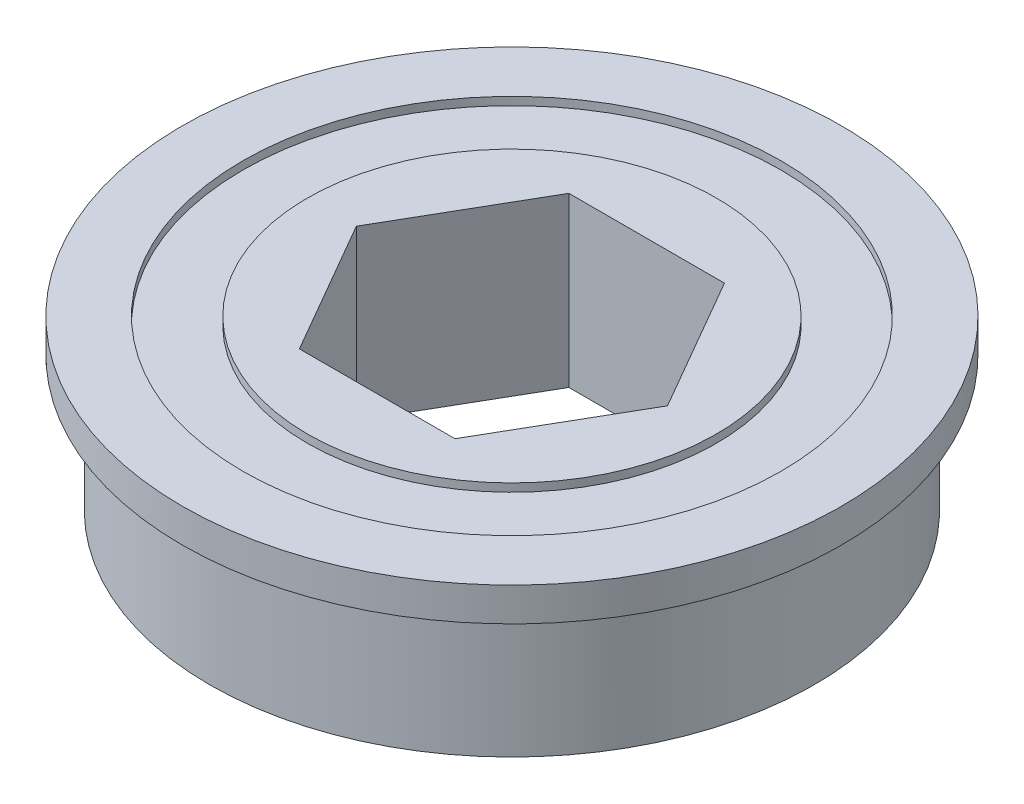
ISO-10303-21;
HEADER;
FILE_DESCRIPTION(('STEP AP214'),'2;1');
FILE_NAME('part.step','',(''),(''),'','','');
FILE_SCHEMA(('AUTOMOTIVE_DESIGN { 1 0 10303 214 1 1 1 1 }'));
ENDSEC;
DATA;
#1=APPLICATION_CONTEXT('core data for automotive mechanical design processes');
#2=APPLICATION_PROTOCOL_DEFINITION('international standard','automotive_design',2000,#1);
#3=PRODUCT_CONTEXT('',#1,'mechanical');
#4=PRODUCT('Part','Part','',(#3));
#5=PRODUCT_RELATED_PRODUCT_CATEGORY('part','',(#4));
#6=PRODUCT_DEFINITION_FORMATION('','',#4);
#7=PRODUCT_DEFINITION_CONTEXT('part definition',#1,'design');
#8=PRODUCT_DEFINITION('design','',#6,#7);
#9=PRODUCT_DEFINITION_SHAPE('','',#8);
#10=(LENGTH_UNIT() NAMED_UNIT(*) SI_UNIT(.MILLI.,.METRE.));
#11=(NAMED_UNIT(*) PLANE_ANGLE_UNIT() SI_UNIT($,.RADIAN.));
#12=(NAMED_UNIT(*) SI_UNIT($,.STERADIAN.) SOLID_ANGLE_UNIT());
#13=UNCERTAINTY_MEASURE_WITH_UNIT(LENGTH_MEASURE(1.E-05),#10,'distance_accuracy_value','');
#14=(GEOMETRIC_REPRESENTATION_CONTEXT(3) GLOBAL_UNCERTAINTY_ASSIGNED_CONTEXT((#13)) GLOBAL_UNIT_ASSIGNED_CONTEXT((#10,
#11,#12)) REPRESENTATION_CONTEXT('',''));
#15=CARTESIAN_POINT('',(0.,0.,0.));
#16=DIRECTION('',(0.,0.,1.));
#17=DIRECTION('',(1.,0.,0.));
#18=AXIS2_PLACEMENT_3D('',#15,#16,#17);
#19=CARTESIAN_POINT('',(0.,0.,0.));
#20=DIRECTION('',(0.,1.,0.));
#21=DIRECTION('',(0.,0.,1.));
#22=AXIS2_PLACEMENT_3D('',#19,#20,#21);
#23=CYLINDRICAL_SURFACE('',#22,12.7);
#24=CARTESIAN_POINT('',(0.,0.381,0.));
#25=DIRECTION('',(0.,1.,0.));
#26=DIRECTION('',(0.,0.,1.));
#27=AXIS2_PLACEMENT_3D('',#24,#25,#26);
#28=CIRCLE('',#27,12.7);
#29=CARTESIAN_POINT('',(0.,0.381,12.7));
#30=VERTEX_POINT('',#29);
#31=EDGE_CURVE('E129',#30,#30,#28,.F.);
#32=ORIENTED_EDGE('',*,*,#31,.F.);
#33=EDGE_LOOP('',(#32));
#34=FACE_BOUND('',#33,.T.);
#35=CARTESIAN_POINT('',(0.,0.,0.));
#36=DIRECTION('',(0.,1.,0.));
#37=DIRECTION('',(0.,0.,1.));
#38=AXIS2_PLACEMENT_3D('',#35,#36,#37);
#39=CIRCLE('',#38,12.7);
#40=CARTESIAN_POINT('',(0.,0.,12.7));
#41=VERTEX_POINT('',#40);
#42=EDGE_CURVE('E126',#41,#41,#39,.T.);
#43=ORIENTED_EDGE('',*,*,#42,.F.);
#44=EDGE_LOOP('',(#43));
#45=FACE_BOUND('',#44,.T.);
#46=ADVANCED_FACE('F17',(#34,#45),#23,.F.);
#47=CARTESIAN_POINT('',(9.652,0.381,0.));
#48=DIRECTION('',(0.,-1.,0.));
#49=DIRECTION('',(0.,0.,-1.));
#50=AXIS2_PLACEMENT_3D('',#47,#48,#49);
#51=PLANE('',#50);
#52=ORIENTED_EDGE('',*,*,#31,.T.);
#53=EDGE_LOOP('',(#52));
#54=FACE_BOUND('',#53,.T.);
#55=CARTESIAN_POINT('',(0.,0.381,0.));
#56=DIRECTION('',(0.,1.,0.));
#57=DIRECTION('',(0.,0.,1.));
#58=AXIS2_PLACEMENT_3D('',#55,#56,#57);
#59=CIRCLE('',#58,9.652);
#60=CARTESIAN_POINT('',(0.,0.381,9.652));
#61=VERTEX_POINT('',#60);
#62=EDGE_CURVE('E123',#61,#61,#59,.F.);
#63=ORIENTED_EDGE('',*,*,#62,.F.);
#64=EDGE_LOOP('',(#63));
#65=FACE_BOUND('',#64,.T.);
#66=ADVANCED_FACE('F358',(#54,#65),#51,.T.);
#67=CARTESIAN_POINT('',(14.2748,0.,0.));
#68=DIRECTION('',(0.,-1.,0.));
#69=DIRECTION('',(0.,0.,-1.));
#70=AXIS2_PLACEMENT_3D('',#67,#68,#69);
#71=PLANE('',#70);
#72=CARTESIAN_POINT('',(0.,0.,0.));
#73=DIRECTION('',(0.,1.,0.));
#74=DIRECTION('',(0.,0.,1.));
#75=AXIS2_PLACEMENT_3D('',#72,#73,#74);
#76=CIRCLE('',#75,14.2748);
#77=CARTESIAN_POINT('',(0.,0.,14.2748));
#78=VERTEX_POINT('',#77);
#79=EDGE_CURVE('E120',#78,#78,#76,.T.);
#80=ORIENTED_EDGE('',*,*,#79,.F.);
#81=EDGE_LOOP('',(#80));
#82=FACE_BOUND('',#81,.T.);
#83=ORIENTED_EDGE('',*,*,#42,.T.);
#84=EDGE_LOOP('',(#83));
#85=FACE_BOUND('',#84,.T.);
#86=ADVANCED_FACE('F348',(#82,#85),#71,.T.);
#87=CARTESIAN_POINT('',(0.,0.,0.));
#88=DIRECTION('',(0.,1.,0.));
#89=DIRECTION('',(0.,0.,1.));
#90=AXIS2_PLACEMENT_3D('',#87,#88,#89);
#91=CYLINDRICAL_SURFACE('',#90,9.652);
#92=CARTESIAN_POINT('',(0.,0.,0.));
#93=DIRECTION('',(0.,1.,0.));
#94=DIRECTION('',(0.,0.,1.));
#95=AXIS2_PLACEMENT_3D('',#92,#93,#94);
#96=CIRCLE('',#95,9.652);
#97=CARTESIAN_POINT('',(0.,0.,9.652));
#98=VERTEX_POINT('',#97);
#99=EDGE_CURVE('E100',#98,#98,#96,.F.);
#100=ORIENTED_EDGE('',*,*,#99,.F.);
#101=EDGE_LOOP('',(#100));
#102=FACE_BOUND('',#101,.T.);
#103=ORIENTED_EDGE('',*,*,#62,.T.);
#104=EDGE_LOOP('',(#103));
#105=FACE_BOUND('',#104,.T.);
#106=ADVANCED_FACE('F338',(#102,#105),#91,.T.);
#107=CARTESIAN_POINT('',(0.,0.,0.));
#108=DIRECTION('',(0.,1.,0.));
#109=DIRECTION('',(0.,0.,1.));
#110=AXIS2_PLACEMENT_3D('',#107,#108,#109);
#111=CYLINDRICAL_SURFACE('',#110,14.2748);
#112=ORIENTED_EDGE('',*,*,#79,.T.);
#113=EDGE_LOOP('',(#112));
#114=FACE_BOUND('',#113,.T.);
#115=CARTESIAN_POINT('',(0.,5.6,0.));
#116=DIRECTION('',(0.,-1.,0.));
#117=DIRECTION('',(0.,0.,-1.));
#118=AXIS2_PLACEMENT_3D('',#115,#116,#117);
#119=CIRCLE('',#118,14.2748);
#120=CARTESIAN_POINT('',(0.,5.6,-14.2748));
#121=VERTEX_POINT('',#120);
#122=EDGE_CURVE('E83',#121,#121,#119,.F.);
#123=ORIENTED_EDGE('',*,*,#122,.F.);
#124=EDGE_LOOP('',(#123));
#125=FACE_BOUND('',#124,.T.);
#126=ADVANCED_FACE('F328',(#114,#125),#111,.T.);
#127=CARTESIAN_POINT('',(9.652,0.,0.));
#128=DIRECTION('',(0.,-1.,0.));
#129=DIRECTION('',(0.,0.,-1.));
#130=AXIS2_PLACEMENT_3D('',#127,#128,#129);
#131=PLANE('',#130);
#132=ORIENTED_EDGE('',*,*,#99,.T.);
#133=EDGE_LOOP('',(#132));
#134=FACE_BOUND('',#133,.T.);
#135=DIRECTION('',(1.,0.,0.));
#136=VECTOR('',#135,1.);
#137=CARTESIAN_POINT('',(-3.67194771204601,0.,6.36));
#138=LINE('',#137,#136);
#139=CARTESIAN_POINT('',(-3.67194771204601,0.,6.36));
#140=VERTEX_POINT('',#139);
#141=CARTESIAN_POINT('',(3.67194771204602,0.,6.36));
#142=VERTEX_POINT('',#141);
#143=EDGE_CURVE('E62',#140,#142,#138,.T.);
#144=ORIENTED_EDGE('',*,*,#143,.T.);
#145=DIRECTION('',(0.5,0.,-0.866025403784439));
#146=VECTOR('',#145,1.);
#147=CARTESIAN_POINT('',(3.67194771204602,0.,6.36));
#148=LINE('',#147,#146);
#149=CARTESIAN_POINT('',(7.34389542409204,0.,0.));
#150=VERTEX_POINT('',#149);
#151=EDGE_CURVE('E64',#142,#150,#148,.T.);
#152=ORIENTED_EDGE('',*,*,#151,.T.);
#153=DIRECTION('',(-0.5,0.,-0.866025403784439));
#154=VECTOR('',#153,1.);
#155=CARTESIAN_POINT('',(7.34389542409204,0.,0.));
#156=LINE('',#155,#154);
#157=CARTESIAN_POINT('',(3.67194771204602,0.,-6.36));
#158=VERTEX_POINT('',#157);
#159=EDGE_CURVE('E67',#150,#158,#156,.T.);
#160=ORIENTED_EDGE('',*,*,#159,.T.);
#161=DIRECTION('',(-1.,0.,0.));
#162=VECTOR('',#161,1.);
#163=CARTESIAN_POINT('',(3.67194771204602,0.,-6.36));
#164=LINE('',#163,#162);
#165=CARTESIAN_POINT('',(-3.67194771204602,0.,-6.36));
#166=VERTEX_POINT('',#165);
#167=EDGE_CURVE('E192',#158,#166,#164,.T.);
#168=ORIENTED_EDGE('',*,*,#167,.T.);
#169=DIRECTION('',(-0.5,0.,0.866025403784439));
#170=VECTOR('',#169,1.);
#171=CARTESIAN_POINT('',(-3.67194771204602,0.,-6.36));
#172=LINE('',#171,#170);
#173=CARTESIAN_POINT('',(-7.34389542409204,0.,0.));
#174=VERTEX_POINT('',#173);
#175=EDGE_CURVE('E198',#166,#174,#172,.T.);
#176=ORIENTED_EDGE('',*,*,#175,.T.);
#177=DIRECTION('',(0.5,0.,0.866025403784439));
#178=VECTOR('',#177,1.);
#179=CARTESIAN_POINT('',(-7.34389542409204,0.,0.));
#180=LINE('',#179,#178);
#181=EDGE_CURVE('E203',#174,#140,#180,.T.);
#182=ORIENTED_EDGE('',*,*,#181,.T.);
#183=EDGE_LOOP('',(#144,#152,#160,#168,#176,#182));
#184=FACE_BOUND('',#183,.T.);
#185=ADVANCED_FACE('F66',(#134,#184),#131,.T.);
#186=CARTESIAN_POINT('',(0.,5.6,0.));
#187=DIRECTION('',(0.,-1.,0.));
#188=DIRECTION('',(0.,0.,-1.));
#189=AXIS2_PLACEMENT_3D('',#186,#187,#188);
#190=CONICAL_SURFACE('',#189,14.2748,0.523598775598298);
#191=CARTESIAN_POINT('',(0.,5.975,0.));
#192=DIRECTION('',(0.,1.,0.));
#193=DIRECTION('',(0.,0.,1.));
#194=AXIS2_PLACEMENT_3D('',#191,#192,#193);
#195=CIRCLE('',#194,14.0582936490539);
#196=CARTESIAN_POINT('',(0.,5.975,14.0582936490539));
#197=VERTEX_POINT('',#196);
#198=EDGE_CURVE('E94',#197,#197,#195,.F.);
#199=ORIENTED_EDGE('',*,*,#198,.T.);
#200=EDGE_LOOP('',(#199));
#201=FACE_BOUND('',#200,.T.);
#202=ORIENTED_EDGE('',*,*,#122,.T.);
#203=EDGE_LOOP('',(#202));
#204=FACE_BOUND('',#203,.T.);
#205=ADVANCED_FACE('F310',(#201,#204),#190,.T.);
#206=CARTESIAN_POINT('',(7.34389542409204,0.,0.));
#207=DIRECTION('',(0.866025403784439,0.,-0.5));
#208=DIRECTION('',(-0.5,0.,-0.866025403784439));
#209=AXIS2_PLACEMENT_3D('',#206,#207,#208);
#210=PLANE('',#209);
#211=DIRECTION('',(0.,1.,0.));
#212=VECTOR('',#211,1.);
#213=CARTESIAN_POINT('',(3.67194771204602,0.,-6.36));
#214=LINE('',#213,#212);
#215=CARTESIAN_POINT('',(3.67194771204602,7.9375,-6.36));
#216=VERTEX_POINT('',#215);
#217=EDGE_CURVE('E81',#216,#158,#214,.F.);
#218=ORIENTED_EDGE('',*,*,#217,.T.);
#219=ORIENTED_EDGE('',*,*,#159,.F.);
#220=DIRECTION('',(0.,1.,0.));
#221=VECTOR('',#220,1.);
#222=CARTESIAN_POINT('',(7.34389542409204,0.,0.));
#223=LINE('',#222,#221);
#224=CARTESIAN_POINT('',(7.34389542409204,7.9375,0.));
#225=VERTEX_POINT('',#224);
#226=EDGE_CURVE('E73',#150,#225,#223,.T.);
#227=ORIENTED_EDGE('',*,*,#226,.T.);
#228=DIRECTION('',(0.5,0.,0.866025403784438));
#229=VECTOR('',#228,1.);
#230=CARTESIAN_POINT('',(3.67194771204602,7.9375,-6.36));
#231=LINE('',#230,#229);
#232=EDGE_CURVE('E97',#216,#225,#231,.T.);
#233=ORIENTED_EDGE('',*,*,#232,.F.);
#234=EDGE_LOOP('',(#218,#219,#227,#233));
#235=FACE_BOUND('',#234,.T.);
#236=ADVANCED_FACE('F77',(#235),#210,.F.);
#237=CARTESIAN_POINT('',(3.67194771204602,0.,6.36));
#238=DIRECTION('',(0.866025403784439,0.,0.5));
#239=DIRECTION('',(0.5,0.,-0.866025403784439));
#240=AXIS2_PLACEMENT_3D('',#237,#238,#239);
#241=PLANE('',#240);
#242=ORIENTED_EDGE('',*,*,#226,.F.);
#243=ORIENTED_EDGE('',*,*,#151,.F.);
#244=DIRECTION('',(0.,1.,0.));
#245=VECTOR('',#244,1.);
#246=CARTESIAN_POINT('',(3.67194771204602,0.,6.36));
#247=LINE('',#246,#245);
#248=CARTESIAN_POINT('',(3.67194771204602,7.9375,6.36));
#249=VERTEX_POINT('',#248);
#250=EDGE_CURVE('E90',#142,#249,#247,.T.);
#251=ORIENTED_EDGE('',*,*,#250,.T.);
#252=DIRECTION('',(-0.5,0.,0.866025403784439));
#253=VECTOR('',#252,1.);
#254=CARTESIAN_POINT('',(7.34389542409204,7.9375,0.));
#255=LINE('',#254,#253);
#256=EDGE_CURVE('E87',#225,#249,#255,.T.);
#257=ORIENTED_EDGE('',*,*,#256,.F.);
#258=EDGE_LOOP('',(#242,#243,#251,#257));
#259=FACE_BOUND('',#258,.T.);
#260=ADVANCED_FACE('F85',(#259),#241,.F.);
#261=CARTESIAN_POINT('',(-3.67194771204601,0.,6.36));
#262=DIRECTION('',(0.,0.,1.));
#263=DIRECTION('',(1.,0.,0.));
#264=AXIS2_PLACEMENT_3D('',#261,#262,#263);
#265=PLANE('',#264);
#266=ORIENTED_EDGE('',*,*,#250,.F.);
#267=ORIENTED_EDGE('',*,*,#143,.F.);
#268=DIRECTION('',(0.,1.,0.));
#269=VECTOR('',#268,1.);
#270=CARTESIAN_POINT('',(-3.67194771204601,0.,6.36));
#271=LINE('',#270,#269);
#272=CARTESIAN_POINT('',(-3.67194771204601,7.9375,6.36));
#273=VERTEX_POINT('',#272);
#274=EDGE_CURVE('E200',#140,#273,#271,.T.);
#275=ORIENTED_EDGE('',*,*,#274,.T.);
#276=DIRECTION('',(1.,0.,0.));
#277=VECTOR('',#276,1.);
#278=CARTESIAN_POINT('',(6.35,7.9375,6.36));
#279=LINE('',#278,#277);
#280=EDGE_CURVE('E185',#249,#273,#279,.F.);
#281=ORIENTED_EDGE('',*,*,#280,.F.);
#282=EDGE_LOOP('',(#266,#267,#275,#281));
#283=FACE_BOUND('',#282,.T.);
#284=ADVANCED_FACE('F209',(#283),#265,.F.);
#285=CARTESIAN_POINT('',(-7.34389542409204,0.,0.));
#286=DIRECTION('',(-0.866025403784439,0.,0.5));
#287=DIRECTION('',(0.5,0.,0.866025403784439));
#288=AXIS2_PLACEMENT_3D('',#285,#286,#287);
#289=PLANE('',#288);
#290=ORIENTED_EDGE('',*,*,#274,.F.);
#291=ORIENTED_EDGE('',*,*,#181,.F.);
#292=DIRECTION('',(0.,1.,0.));
#293=VECTOR('',#292,1.);
#294=CARTESIAN_POINT('',(-7.34389542409204,0.,0.));
#295=LINE('',#294,#293);
#296=CARTESIAN_POINT('',(-7.34389542409204,7.9375,0.));
#297=VERTEX_POINT('',#296);
#298=EDGE_CURVE('E195',#174,#297,#295,.T.);
#299=ORIENTED_EDGE('',*,*,#298,.T.);
#300=DIRECTION('',(-0.5,0.,-0.866025403784439));
#301=VECTOR('',#300,1.);
#302=CARTESIAN_POINT('',(-3.67194771204601,7.9375,6.36));
#303=LINE('',#302,#301);
#304=EDGE_CURVE('E182',#273,#297,#303,.T.);
#305=ORIENTED_EDGE('',*,*,#304,.F.);
#306=EDGE_LOOP('',(#290,#291,#299,#305));
#307=FACE_BOUND('',#306,.T.);
#308=ADVANCED_FACE('F225',(#307),#289,.F.);
#309=CARTESIAN_POINT('',(-3.67194771204602,0.,-6.36));
#310=DIRECTION('',(-0.866025403784439,0.,-0.5));
#311=DIRECTION('',(-0.5,0.,0.866025403784439));
#312=AXIS2_PLACEMENT_3D('',#309,#310,#311);
#313=PLANE('',#312);
#314=ORIENTED_EDGE('',*,*,#298,.F.);
#315=ORIENTED_EDGE('',*,*,#175,.F.);
#316=DIRECTION('',(0.,1.,0.));
#317=VECTOR('',#316,1.);
#318=CARTESIAN_POINT('',(-3.67194771204602,0.,-6.36));
#319=LINE('',#318,#317);
#320=CARTESIAN_POINT('',(-3.67194771204602,7.9375,-6.36));
#321=VERTEX_POINT('',#320);
#322=EDGE_CURVE('E98',#166,#321,#319,.T.);
#323=ORIENTED_EDGE('',*,*,#322,.T.);
#324=DIRECTION('',(0.5,0.,-0.866025403784439));
#325=VECTOR('',#324,1.);
#326=CARTESIAN_POINT('',(-7.34389542409204,7.9375,0.));
#327=LINE('',#326,#325);
#328=EDGE_CURVE('E179',#297,#321,#327,.T.);
#329=ORIENTED_EDGE('',*,*,#328,.F.);
#330=EDGE_LOOP('',(#314,#315,#323,#329));
#331=FACE_BOUND('',#330,.T.);
#332=ADVANCED_FACE('F221',(#331),#313,.F.);
#333=CARTESIAN_POINT('',(3.67194771204602,0.,-6.36));
#334=DIRECTION('',(0.,0.,-1.));
#335=DIRECTION('',(-1.,0.,0.));
#336=AXIS2_PLACEMENT_3D('',#333,#334,#335);
#337=PLANE('',#336);
#338=ORIENTED_EDGE('',*,*,#322,.F.);
#339=ORIENTED_EDGE('',*,*,#167,.F.);
#340=ORIENTED_EDGE('',*,*,#217,.F.);
#341=DIRECTION('',(1.,0.,0.));
#342=VECTOR('',#341,1.);
#343=CARTESIAN_POINT('',(6.35,7.9375,-6.36));
#344=LINE('',#343,#342);
#345=EDGE_CURVE('E117',#321,#216,#344,.T.);
#346=ORIENTED_EDGE('',*,*,#345,.F.);
#347=EDGE_LOOP('',(#338,#339,#340,#346));
#348=FACE_BOUND('',#347,.T.);
#349=ADVANCED_FACE('F216',(#348),#337,.F.);
#350=CARTESIAN_POINT('',(6.35,7.9375,0.));
#351=DIRECTION('',(0.,1.,0.));
#352=DIRECTION('',(0.,0.,1.));
#353=AXIS2_PLACEMENT_3D('',#350,#351,#352);
#354=PLANE('',#353);
#355=CARTESIAN_POINT('',(0.,7.9375,0.));
#356=DIRECTION('',(0.,1.,0.));
#357=DIRECTION('',(0.,0.,1.));
#358=AXIS2_PLACEMENT_3D('',#355,#356,#357);
#359=CIRCLE('',#358,9.652);
#360=CARTESIAN_POINT('',(0.,7.9375,9.652));
#361=VERTEX_POINT('',#360);
#362=EDGE_CURVE('E113',#361,#361,#359,.F.);
#363=ORIENTED_EDGE('',*,*,#362,.F.);
#364=EDGE_LOOP('',(#363));
#365=FACE_BOUND('',#364,.T.);
#366=ORIENTED_EDGE('',*,*,#328,.T.);
#367=ORIENTED_EDGE('',*,*,#345,.T.);
#368=ORIENTED_EDGE('',*,*,#232,.T.);
#369=ORIENTED_EDGE('',*,*,#256,.T.);
#370=ORIENTED_EDGE('',*,*,#280,.T.);
#371=ORIENTED_EDGE('',*,*,#304,.T.);
#372=EDGE_LOOP('',(#366,#367,#368,#369,#370,#371));
#373=FACE_BOUND('',#372,.T.);
#374=ADVANCED_FACE('F164',(#365,#373),#354,.T.);
#375=CARTESIAN_POINT('',(0.,6.1,0.));
#376=DIRECTION('',(0.,1.,0.));
#377=DIRECTION('',(0.,0.,1.));
#378=AXIS2_PLACEMENT_3D('',#375,#376,#377);
#379=TOROIDAL_SURFACE('',#378,14.2748,0.25);
#380=ORIENTED_EDGE('',*,*,#198,.F.);
#381=EDGE_LOOP('',(#380));
#382=FACE_BOUND('',#381,.T.);
#383=CARTESIAN_POINT('',(0.,6.35,0.));
#384=DIRECTION('',(0.,-1.,0.));
#385=DIRECTION('',(0.,0.,-1.));
#386=AXIS2_PLACEMENT_3D('',#383,#384,#385);
#387=CIRCLE('',#386,14.2748);
#388=CARTESIAN_POINT('',(0.,6.35,14.2748));
#389=VERTEX_POINT('',#388);
#390=CARTESIAN_POINT('',(0.,6.35,-14.2748));
#391=VERTEX_POINT('',#390);
#392=EDGE_CURVE('E116',#389,#391,#387,.F.);
#393=ORIENTED_EDGE('',*,*,#392,.F.);
#394=CARTESIAN_POINT('',(0.,6.35,0.));
#395=DIRECTION('',(0.,-1.,0.));
#396=DIRECTION('',(0.,0.,1.));
#397=AXIS2_PLACEMENT_3D('',#394,#395,#396);
#398=CIRCLE('',#397,14.2748);
#399=EDGE_CURVE('E36',#391,#389,#398,.F.);
#400=ORIENTED_EDGE('',*,*,#399,.F.);
#401=EDGE_LOOP('',(#393,#400));
#402=FACE_BOUND('',#401,.T.);
#403=ADVANCED_FACE('F131',(#382,#402),#379,.F.);
#404=CARTESIAN_POINT('',(0.,0.,0.));
#405=DIRECTION('',(0.,1.,0.));
#406=DIRECTION('',(0.,0.,1.));
#407=AXIS2_PLACEMENT_3D('',#404,#405,#406);
#408=CYLINDRICAL_SURFACE('',#407,9.652);
#409=CARTESIAN_POINT('',(0.,7.5565,0.));
#410=DIRECTION('',(0.,1.,0.));
#411=DIRECTION('',(0.,0.,1.));
#412=AXIS2_PLACEMENT_3D('',#409,#410,#411);
#413=CIRCLE('',#412,9.652);
#414=CARTESIAN_POINT('',(0.,7.5565,9.652));
#415=VERTEX_POINT('',#414);
#416=EDGE_CURVE('E110',#415,#415,#413,.F.);
#417=ORIENTED_EDGE('',*,*,#416,.F.);
#418=EDGE_LOOP('',(#417));
#419=FACE_BOUND('',#418,.T.);
#420=ORIENTED_EDGE('',*,*,#362,.T.);
#421=EDGE_LOOP('',(#420));
#422=FACE_BOUND('',#421,.T.);
#423=ADVANCED_FACE('F155',(#419,#422),#408,.T.);
#424=CARTESIAN_POINT('',(15.5575,6.35,0.));
#425=DIRECTION('',(0.,-1.,0.));
#426=DIRECTION('',(0.,0.,-1.));
#427=AXIS2_PLACEMENT_3D('',#424,#425,#426);
#428=PLANE('',#427);
#429=CARTESIAN_POINT('',(0.,6.35,0.));
#430=DIRECTION('',(0.,1.,0.));
#431=DIRECTION('',(0.,0.,1.));
#432=AXIS2_PLACEMENT_3D('',#429,#430,#431);
#433=CIRCLE('',#432,15.5575);
#434=CARTESIAN_POINT('',(0.,6.35,15.5575));
#435=VERTEX_POINT('',#434);
#436=EDGE_CURVE('E107',#435,#435,#433,.T.);
#437=ORIENTED_EDGE('',*,*,#436,.F.);
#438=EDGE_LOOP('',(#437));
#439=FACE_BOUND('',#438,.T.);
#440=ORIENTED_EDGE('',*,*,#392,.T.);
#441=ORIENTED_EDGE('',*,*,#399,.T.);
#442=EDGE_LOOP('',(#440,#441));
#443=FACE_BOUND('',#442,.T.);
#444=ADVANCED_FACE('F135',(#439,#443),#428,.T.);
#445=CARTESIAN_POINT('',(9.652,7.5565,0.));
#446=DIRECTION('',(0.,1.,0.));
#447=DIRECTION('',(0.,0.,1.));
#448=AXIS2_PLACEMENT_3D('',#445,#446,#447);
#449=PLANE('',#448);
#450=ORIENTED_EDGE('',*,*,#416,.T.);
#451=EDGE_LOOP('',(#450));
#452=FACE_BOUND('',#451,.T.);
#453=CARTESIAN_POINT('',(0.,7.5565,0.));
#454=DIRECTION('',(0.,1.,0.));
#455=DIRECTION('',(0.,0.,1.));
#456=AXIS2_PLACEMENT_3D('',#453,#454,#455);
#457=CIRCLE('',#456,12.7);
#458=CARTESIAN_POINT('',(0.,7.5565,12.7));
#459=VERTEX_POINT('',#458);
#460=EDGE_CURVE('E104',#459,#459,#457,.T.);
#461=ORIENTED_EDGE('',*,*,#460,.T.);
#462=EDGE_LOOP('',(#461));
#463=FACE_BOUND('',#462,.T.);
#464=ADVANCED_FACE('F154',(#452,#463),#449,.T.);
#465=CARTESIAN_POINT('',(0.,0.,0.));
#466=DIRECTION('',(0.,1.,0.));
#467=DIRECTION('',(0.,0.,1.));
#468=AXIS2_PLACEMENT_3D('',#465,#466,#467);
#469=CYLINDRICAL_SURFACE('',#468,15.5575);
#470=ORIENTED_EDGE('',*,*,#436,.T.);
#471=EDGE_LOOP('',(#470));
#472=FACE_BOUND('',#471,.T.);
#473=CARTESIAN_POINT('',(0.,7.9375,0.));
#474=DIRECTION('',(0.,1.,0.));
#475=DIRECTION('',(0.,0.,1.));
#476=AXIS2_PLACEMENT_3D('',#473,#474,#475);
#477=CIRCLE('',#476,15.5575);
#478=CARTESIAN_POINT('',(0.,7.9375,15.5575));
#479=VERTEX_POINT('',#478);
#480=EDGE_CURVE('E28',#479,#479,#477,.T.);
#481=ORIENTED_EDGE('',*,*,#480,.F.);
#482=EDGE_LOOP('',(#481));
#483=FACE_BOUND('',#482,.T.);
#484=ADVANCED_FACE('F246',(#472,#483),#469,.T.);
#485=CARTESIAN_POINT('',(0.,0.,0.));
#486=DIRECTION('',(0.,1.,0.));
#487=DIRECTION('',(0.,0.,1.));
#488=AXIS2_PLACEMENT_3D('',#485,#486,#487);
#489=CYLINDRICAL_SURFACE('',#488,12.7);
#490=CARTESIAN_POINT('',(0.,7.9375,0.));
#491=DIRECTION('',(0.,1.,0.));
#492=DIRECTION('',(0.,0.,1.));
#493=AXIS2_PLACEMENT_3D('',#490,#491,#492);
#494=CIRCLE('',#493,12.7);
#495=CARTESIAN_POINT('',(0.,7.9375,12.7));
#496=VERTEX_POINT('',#495);
#497=EDGE_CURVE('E11',#496,#496,#494,.F.);
#498=ORIENTED_EDGE('',*,*,#497,.F.);
#499=EDGE_LOOP('',(#498));
#500=FACE_BOUND('',#499,.T.);
#501=ORIENTED_EDGE('',*,*,#460,.F.);
#502=EDGE_LOOP('',(#501));
#503=FACE_BOUND('',#502,.T.);
#504=ADVANCED_FACE('F240',(#500,#503),#489,.F.);
#505=CARTESIAN_POINT('',(12.7,7.9375,0.));
#506=DIRECTION('',(0.,1.,0.));
#507=DIRECTION('',(0.,0.,1.));
#508=AXIS2_PLACEMENT_3D('',#505,#506,#507);
#509=PLANE('',#508);
#510=ORIENTED_EDGE('',*,*,#497,.T.);
#511=EDGE_LOOP('',(#510));
#512=FACE_BOUND('',#511,.T.);
#513=ORIENTED_EDGE('',*,*,#480,.T.);
#514=EDGE_LOOP('',(#513));
#515=FACE_BOUND('',#514,.T.);
#516=ADVANCED_FACE('F238',(#512,#515),#509,.T.);
#517=CLOSED_SHELL('',(#46,#66,#86,#106,#126,#185,#205,#236,#260,#284,#308,#332,#349,#374,#403,
#423,#444,#464,#484,#504,#516));
#518=MANIFOLD_SOLID_BREP('B1',#517);
#519=ADVANCED_BREP_SHAPE_REPRESENTATION('',(#18,#518),#14);
#520=SHAPE_DEFINITION_REPRESENTATION(#9,#519);
ENDSEC;
END-ISO-10303-21;
